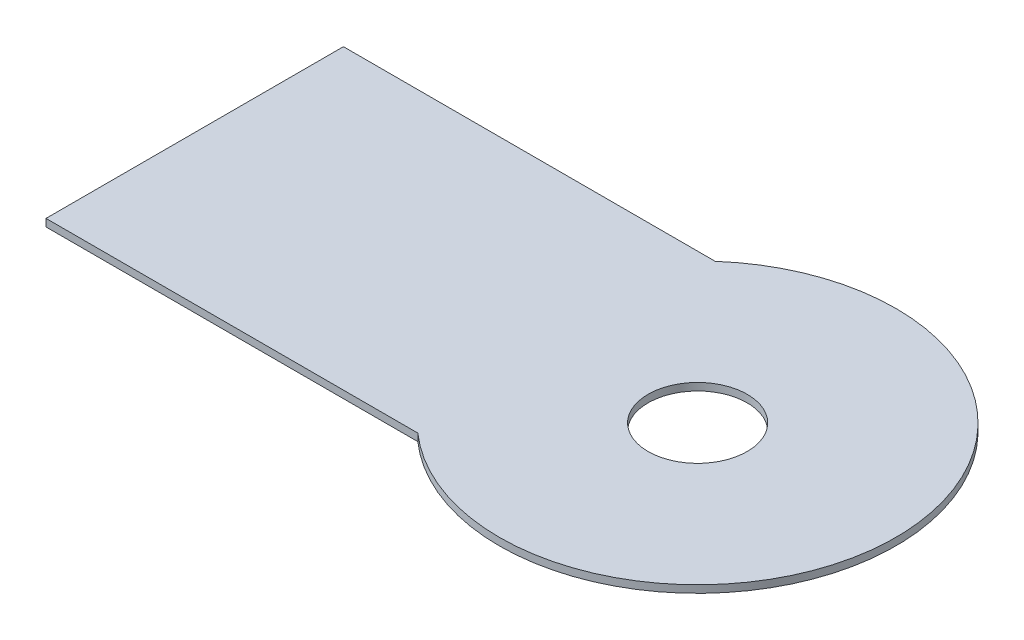
ISO-10303-21;
HEADER;
FILE_DESCRIPTION(('STEP AP214'),'2;1');
FILE_NAME('part.step','',(''),(''),'','','');
FILE_SCHEMA(('AUTOMOTIVE_DESIGN { 1 0 10303 214 1 1 1 1 }'));
ENDSEC;
DATA;
#1=APPLICATION_CONTEXT('core data for automotive mechanical design processes');
#2=APPLICATION_PROTOCOL_DEFINITION('international standard','automotive_design',2000,#1);
#3=PRODUCT_CONTEXT('',#1,'mechanical');
#4=PRODUCT('Part','Part','',(#3));
#5=PRODUCT_RELATED_PRODUCT_CATEGORY('part','',(#4));
#6=PRODUCT_DEFINITION_FORMATION('','',#4);
#7=PRODUCT_DEFINITION_CONTEXT('part definition',#1,'design');
#8=PRODUCT_DEFINITION('design','',#6,#7);
#9=PRODUCT_DEFINITION_SHAPE('','',#8);
#10=(LENGTH_UNIT() NAMED_UNIT(*) SI_UNIT(.MILLI.,.METRE.));
#11=(NAMED_UNIT(*) PLANE_ANGLE_UNIT() SI_UNIT($,.RADIAN.));
#12=(NAMED_UNIT(*) SI_UNIT($,.STERADIAN.) SOLID_ANGLE_UNIT());
#13=UNCERTAINTY_MEASURE_WITH_UNIT(LENGTH_MEASURE(1.E-05),#10,'distance_accuracy_value','');
#14=(GEOMETRIC_REPRESENTATION_CONTEXT(3) GLOBAL_UNCERTAINTY_ASSIGNED_CONTEXT((#13)) GLOBAL_UNIT_ASSIGNED_CONTEXT((#10,
#11,#12)) REPRESENTATION_CONTEXT('',''));
#15=CARTESIAN_POINT('',(0.,0.,0.));
#16=DIRECTION('',(0.,0.,1.));
#17=DIRECTION('',(1.,0.,0.));
#18=AXIS2_PLACEMENT_3D('',#15,#16,#17);
#19=CARTESIAN_POINT('',(0.,-3.,0.));
#20=DIRECTION('',(-1.,0.,0.));
#21=DIRECTION('',(0.,0.,1.));
#22=AXIS2_PLACEMENT_3D('',#19,#20,#21);
#23=PLANE('',#22);
#24=DIRECTION('',(0.,0.,1.));
#25=VECTOR('',#24,1.);
#26=CARTESIAN_POINT('',(0.,0.,0.));
#27=LINE('',#26,#25);
#28=CARTESIAN_POINT('',(0.,0.,-120.));
#29=VERTEX_POINT('',#28);
#30=CARTESIAN_POINT('',(0.,0.,0.));
#31=VERTEX_POINT('',#30);
#32=EDGE_CURVE('E102',#29,#31,#27,.T.);
#33=ORIENTED_EDGE('',*,*,#32,.F.);
#34=DIRECTION('',(0.,1.,0.));
#35=VECTOR('',#34,1.);
#36=CARTESIAN_POINT('',(0.,-3.,-120.));
#37=LINE('',#36,#35);
#38=CARTESIAN_POINT('',(0.,-3.,-120.));
#39=VERTEX_POINT('',#38);
#40=EDGE_CURVE('E11',#39,#29,#37,.T.);
#41=ORIENTED_EDGE('',*,*,#40,.F.);
#42=DIRECTION('',(0.,0.,1.));
#43=VECTOR('',#42,1.);
#44=CARTESIAN_POINT('',(0.,-3.,0.));
#45=LINE('',#44,#43);
#46=CARTESIAN_POINT('',(0.,-3.,0.));
#47=VERTEX_POINT('',#46);
#48=EDGE_CURVE('E95',#39,#47,#45,.T.);
#49=ORIENTED_EDGE('',*,*,#48,.T.);
#50=DIRECTION('',(0.,1.,0.));
#51=VECTOR('',#50,1.);
#52=CARTESIAN_POINT('',(0.,-3.,0.));
#53=LINE('',#52,#51);
#54=EDGE_CURVE('E40',#47,#31,#53,.T.);
#55=ORIENTED_EDGE('',*,*,#54,.T.);
#56=EDGE_LOOP('',(#33,#41,#49,#55));
#57=FACE_BOUND('',#56,.T.);
#58=ADVANCED_FACE('F37',(#57),#23,.T.);
#59=CARTESIAN_POINT('',(0.,-3.,-120.));
#60=DIRECTION('',(0.,0.,-1.));
#61=DIRECTION('',(-1.,0.,0.));
#62=AXIS2_PLACEMENT_3D('',#59,#60,#61);
#63=PLANE('',#62);
#64=DIRECTION('',(-1.,0.,0.));
#65=VECTOR('',#64,1.);
#66=CARTESIAN_POINT('',(0.,0.,-120.));
#67=LINE('',#66,#65);
#68=CARTESIAN_POINT('',(150.,0.,-120.));
#69=VERTEX_POINT('',#68);
#70=EDGE_CURVE('E97',#69,#29,#67,.T.);
#71=ORIENTED_EDGE('',*,*,#70,.F.);
#72=DIRECTION('',(0.,1.,0.));
#73=VECTOR('',#72,1.);
#74=CARTESIAN_POINT('',(150.,-3.,-120.));
#75=LINE('',#74,#73);
#76=CARTESIAN_POINT('',(150.,-3.,-120.));
#77=VERTEX_POINT('',#76);
#78=EDGE_CURVE('E46',#77,#69,#75,.T.);
#79=ORIENTED_EDGE('',*,*,#78,.F.);
#80=DIRECTION('',(-1.,0.,0.));
#81=VECTOR('',#80,1.);
#82=CARTESIAN_POINT('',(0.,-3.,-120.));
#83=LINE('',#82,#81);
#84=EDGE_CURVE('E92',#77,#39,#83,.T.);
#85=ORIENTED_EDGE('',*,*,#84,.T.);
#86=ORIENTED_EDGE('',*,*,#40,.T.);
#87=EDGE_LOOP('',(#71,#79,#85,#86));
#88=FACE_BOUND('',#87,.T.);
#89=ADVANCED_FACE('F113',(#88),#63,.T.);
#90=CARTESIAN_POINT('',(202.915026221292,-3.,-60.));
#91=DIRECTION('',(0.,1.,0.));
#92=DIRECTION('',(0.,0.,1.));
#93=AXIS2_PLACEMENT_3D('',#90,#91,#92);
#94=CYLINDRICAL_SURFACE('',#93,80.);
#95=CARTESIAN_POINT('',(202.915026221292,0.,-60.));
#96=DIRECTION('',(0.,1.,0.));
#97=DIRECTION('',(0.,0.,1.));
#98=AXIS2_PLACEMENT_3D('',#95,#96,#97);
#99=CIRCLE('',#98,80.);
#100=CARTESIAN_POINT('',(150.,0.,0.));
#101=VERTEX_POINT('',#100);
#102=EDGE_CURVE('E87',#101,#69,#99,.T.);
#103=ORIENTED_EDGE('',*,*,#102,.F.);
#104=DIRECTION('',(0.,1.,0.));
#105=VECTOR('',#104,1.);
#106=CARTESIAN_POINT('',(150.,-3.,0.));
#107=LINE('',#106,#105);
#108=CARTESIAN_POINT('',(150.,-3.,0.));
#109=VERTEX_POINT('',#108);
#110=EDGE_CURVE('E82',#109,#101,#107,.T.);
#111=ORIENTED_EDGE('',*,*,#110,.F.);
#112=CARTESIAN_POINT('',(202.915026221292,-3.,-60.));
#113=DIRECTION('',(0.,1.,0.));
#114=DIRECTION('',(0.,0.,1.));
#115=AXIS2_PLACEMENT_3D('',#112,#113,#114);
#116=CIRCLE('',#115,80.);
#117=EDGE_CURVE('E85',#109,#77,#116,.T.);
#118=ORIENTED_EDGE('',*,*,#117,.T.);
#119=ORIENTED_EDGE('',*,*,#78,.T.);
#120=EDGE_LOOP('',(#103,#111,#118,#119));
#121=FACE_BOUND('',#120,.T.);
#122=ADVANCED_FACE('F84',(#121),#94,.T.);
#123=CARTESIAN_POINT('',(0.,-3.,0.));
#124=DIRECTION('',(0.,0.,1.));
#125=DIRECTION('',(1.,0.,0.));
#126=AXIS2_PLACEMENT_3D('',#123,#124,#125);
#127=PLANE('',#126);
#128=DIRECTION('',(1.,0.,0.));
#129=VECTOR('',#128,1.);
#130=CARTESIAN_POINT('',(0.,0.,0.));
#131=LINE('',#130,#129);
#132=EDGE_CURVE('E105',#31,#101,#131,.T.);
#133=ORIENTED_EDGE('',*,*,#132,.F.);
#134=ORIENTED_EDGE('',*,*,#54,.F.);
#135=DIRECTION('',(1.,0.,0.));
#136=VECTOR('',#135,1.);
#137=CARTESIAN_POINT('',(0.,-3.,0.));
#138=LINE('',#137,#136);
#139=EDGE_CURVE('E91',#47,#109,#138,.T.);
#140=ORIENTED_EDGE('',*,*,#139,.T.);
#141=ORIENTED_EDGE('',*,*,#110,.T.);
#142=EDGE_LOOP('',(#133,#134,#140,#141));
#143=FACE_BOUND('',#142,.T.);
#144=ADVANCED_FACE('F94',(#143),#127,.T.);
#145=CARTESIAN_POINT('',(202.915026221292,-3.,-60.));
#146=DIRECTION('',(0.,1.,0.));
#147=DIRECTION('',(0.,0.,1.));
#148=AXIS2_PLACEMENT_3D('',#145,#146,#147);
#149=PLANE('',#148);
#150=CARTESIAN_POINT('',(202.915026221292,-3.,-60.));
#151=DIRECTION('',(0.,1.,0.));
#152=DIRECTION('',(0.,0.,1.));
#153=AXIS2_PLACEMENT_3D('',#150,#151,#152);
#154=CIRCLE('',#153,20.);
#155=CARTESIAN_POINT('',(202.915026221292,-3.,-40.));
#156=VERTEX_POINT('',#155);
#157=EDGE_CURVE('E106',#156,#156,#154,.T.);
#158=ORIENTED_EDGE('',*,*,#157,.T.);
#159=EDGE_LOOP('',(#158));
#160=FACE_BOUND('',#159,.T.);
#161=ORIENTED_EDGE('',*,*,#48,.F.);
#162=ORIENTED_EDGE('',*,*,#84,.F.);
#163=ORIENTED_EDGE('',*,*,#117,.F.);
#164=ORIENTED_EDGE('',*,*,#139,.F.);
#165=EDGE_LOOP('',(#161,#162,#163,#164));
#166=FACE_BOUND('',#165,.T.);
#167=ADVANCED_FACE('F90',(#160,#166),#149,.F.);
#168=CARTESIAN_POINT('',(202.915026221292,0.,-60.));
#169=DIRECTION('',(0.,1.,0.));
#170=DIRECTION('',(0.,0.,1.));
#171=AXIS2_PLACEMENT_3D('',#168,#169,#170);
#172=PLANE('',#171);
#173=CARTESIAN_POINT('',(202.915026221292,0.,-60.));
#174=DIRECTION('',(0.,1.,0.));
#175=DIRECTION('',(0.,0.,1.));
#176=AXIS2_PLACEMENT_3D('',#173,#174,#175);
#177=CIRCLE('',#176,20.);
#178=CARTESIAN_POINT('',(202.915026221292,0.,-40.));
#179=VERTEX_POINT('',#178);
#180=EDGE_CURVE('E143',#179,#179,#177,.T.);
#181=ORIENTED_EDGE('',*,*,#180,.F.);
#182=EDGE_LOOP('',(#181));
#183=FACE_BOUND('',#182,.T.);
#184=ORIENTED_EDGE('',*,*,#32,.T.);
#185=ORIENTED_EDGE('',*,*,#132,.T.);
#186=ORIENTED_EDGE('',*,*,#102,.T.);
#187=ORIENTED_EDGE('',*,*,#70,.T.);
#188=EDGE_LOOP('',(#184,#185,#186,#187));
#189=FACE_BOUND('',#188,.T.);
#190=ADVANCED_FACE('F112',(#183,#189),#172,.T.);
#191=CARTESIAN_POINT('',(202.915026221292,-3.,-60.));
#192=DIRECTION('',(0.,1.,0.));
#193=DIRECTION('',(0.,0.,1.));
#194=AXIS2_PLACEMENT_3D('',#191,#192,#193);
#195=CYLINDRICAL_SURFACE('',#194,20.);
#196=ORIENTED_EDGE('',*,*,#157,.F.);
#197=EDGE_LOOP('',(#196));
#198=FACE_BOUND('',#197,.T.);
#199=ORIENTED_EDGE('',*,*,#180,.T.);
#200=EDGE_LOOP('',(#199));
#201=FACE_BOUND('',#200,.T.);
#202=ADVANCED_FACE('F131',(#198,#201),#195,.F.);
#203=CLOSED_SHELL('',(#58,#89,#122,#144,#167,#190,#202));
#204=MANIFOLD_SOLID_BREP('B2',#203);
#205=ADVANCED_BREP_SHAPE_REPRESENTATION('',(#18,#204),#14);
#206=SHAPE_DEFINITION_REPRESENTATION(#9,#205);
ENDSEC;
END-ISO-10303-21;
